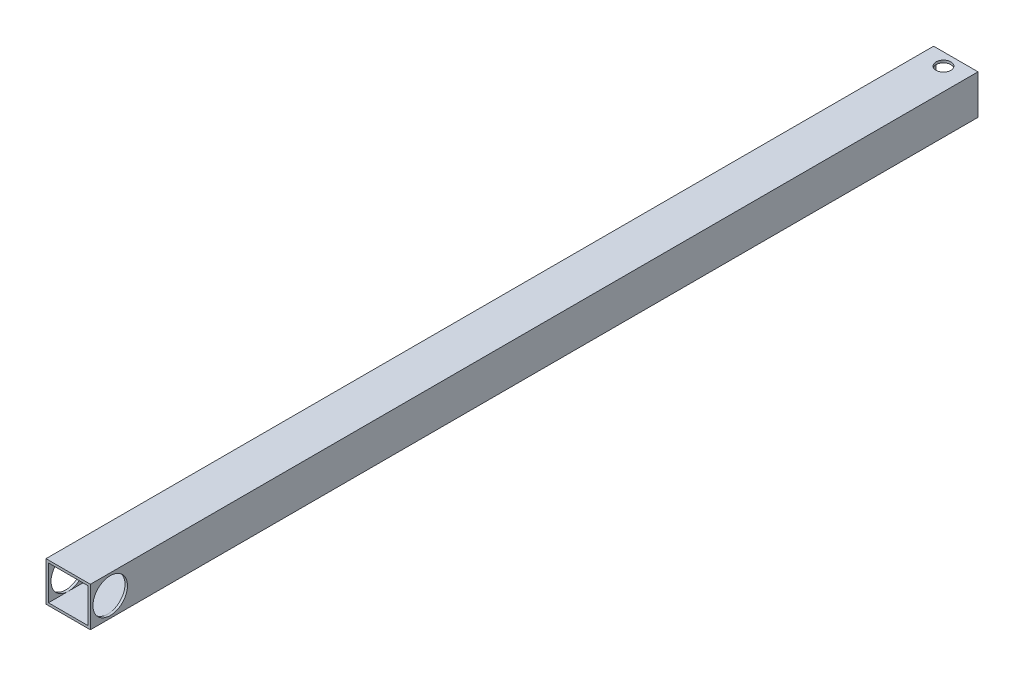
ISO-10303-21;
HEADER;
FILE_DESCRIPTION(('STEP AP214'),'2;1');
FILE_NAME('part.step','',(''),(''),'','','');
FILE_SCHEMA(('AUTOMOTIVE_DESIGN { 1 0 10303 214 1 1 1 1 }'));
ENDSEC;
DATA;
#1=APPLICATION_CONTEXT('core data for automotive mechanical design processes');
#2=APPLICATION_PROTOCOL_DEFINITION('international standard','automotive_design',2000,#1);
#3=PRODUCT_CONTEXT('',#1,'mechanical');
#4=PRODUCT('Part','Part','',(#3));
#5=PRODUCT_RELATED_PRODUCT_CATEGORY('part','',(#4));
#6=PRODUCT_DEFINITION_FORMATION('','',#4);
#7=PRODUCT_DEFINITION_CONTEXT('part definition',#1,'design');
#8=PRODUCT_DEFINITION('design','',#6,#7);
#9=PRODUCT_DEFINITION_SHAPE('','',#8);
#10=(LENGTH_UNIT() NAMED_UNIT(*) SI_UNIT(.MILLI.,.METRE.));
#11=(NAMED_UNIT(*) PLANE_ANGLE_UNIT() SI_UNIT($,.RADIAN.));
#12=(NAMED_UNIT(*) SI_UNIT($,.STERADIAN.) SOLID_ANGLE_UNIT());
#13=UNCERTAINTY_MEASURE_WITH_UNIT(LENGTH_MEASURE(1.E-05),#10,'distance_accuracy_value','');
#14=(GEOMETRIC_REPRESENTATION_CONTEXT(3) GLOBAL_UNCERTAINTY_ASSIGNED_CONTEXT((#13)) GLOBAL_UNIT_ASSIGNED_CONTEXT((#10,
#11,#12)) REPRESENTATION_CONTEXT('',''));
#15=CARTESIAN_POINT('',(0.,0.,0.));
#16=DIRECTION('',(0.,0.,1.));
#17=DIRECTION('',(1.,0.,0.));
#18=AXIS2_PLACEMENT_3D('',#15,#16,#17);
#19=CARTESIAN_POINT('',(4.,3.5,180.));
#20=DIRECTION('',(-1.,0.,0.));
#21=DIRECTION('',(0.,0.,1.));
#22=AXIS2_PLACEMENT_3D('',#19,#20,#21);
#23=PLANE('',#22);
#24=CARTESIAN_POINT('',(4.,0.,175.980500670806));
#25=DIRECTION('',(-1.,0.,0.));
#26=DIRECTION('',(0.,0.,1.));
#27=AXIS2_PLACEMENT_3D('',#24,#25,#26);
#28=CIRCLE('',#27,3.49999999999999);
#29=CARTESIAN_POINT('',(4.,3.5,175.980500670806));
#30=VERTEX_POINT('',#29);
#31=CARTESIAN_POINT('',(4.,-3.5,175.980500670806));
#32=VERTEX_POINT('',#31);
#33=EDGE_CURVE('E55',#30,#32,#28,.T.);
#34=ORIENTED_EDGE('',*,*,#33,.F.);
#35=DIRECTION('',(0.,0.,-1.));
#36=VECTOR('',#35,1.);
#37=CARTESIAN_POINT('',(4.,3.5,180.));
#38=LINE('',#37,#36);
#39=CARTESIAN_POINT('',(4.,3.5,0.));
#40=VERTEX_POINT('',#39);
#41=EDGE_CURVE('E143',#30,#40,#38,.T.);
#42=ORIENTED_EDGE('',*,*,#41,.T.);
#43=DIRECTION('',(0.,1.,0.));
#44=VECTOR('',#43,1.);
#45=CARTESIAN_POINT('',(4.,3.5,0.));
#46=LINE('',#45,#44);
#47=CARTESIAN_POINT('',(4.,-3.5,0.));
#48=VERTEX_POINT('',#47);
#49=EDGE_CURVE('E235',#48,#40,#46,.T.);
#50=ORIENTED_EDGE('',*,*,#49,.F.);
#51=DIRECTION('',(0.,0.,-1.));
#52=VECTOR('',#51,1.);
#53=CARTESIAN_POINT('',(4.,-3.5,180.));
#54=LINE('',#53,#52);
#55=EDGE_CURVE('E233',#32,#48,#54,.T.);
#56=ORIENTED_EDGE('',*,*,#55,.F.);
#57=EDGE_LOOP('',(#34,#42,#50,#56));
#58=FACE_BOUND('',#57,.T.);
#59=ADVANCED_FACE('F41',(#58),#23,.T.);
#60=CARTESIAN_POINT('',(-4.,3.5,180.));
#61=DIRECTION('',(1.,0.,0.));
#62=DIRECTION('',(0.,0.,-1.));
#63=AXIS2_PLACEMENT_3D('',#60,#61,#62);
#64=PLANE('',#63);
#65=CARTESIAN_POINT('',(-4.,0.,175.980500670806));
#66=DIRECTION('',(1.,0.,0.));
#67=DIRECTION('',(0.,0.,-1.));
#68=AXIS2_PLACEMENT_3D('',#65,#66,#67);
#69=CIRCLE('',#68,3.49999999999999);
#70=CARTESIAN_POINT('',(-4.,3.5,175.980500670806));
#71=VERTEX_POINT('',#70);
#72=CARTESIAN_POINT('',(-4.,-3.5,175.980500670806));
#73=VERTEX_POINT('',#72);
#74=EDGE_CURVE('E11',#71,#73,#69,.T.);
#75=ORIENTED_EDGE('',*,*,#74,.F.);
#76=DIRECTION('',(0.,0.,-1.));
#77=VECTOR('',#76,1.);
#78=CARTESIAN_POINT('',(-4.,3.5,180.));
#79=LINE('',#78,#77);
#80=CARTESIAN_POINT('',(-4.,3.5,180.));
#81=VERTEX_POINT('',#80);
#82=EDGE_CURVE('E125',#81,#71,#79,.T.);
#83=ORIENTED_EDGE('',*,*,#82,.F.);
#84=DIRECTION('',(0.,-1.,0.));
#85=VECTOR('',#84,1.);
#86=CARTESIAN_POINT('',(-4.,3.5,180.));
#87=LINE('',#86,#85);
#88=CARTESIAN_POINT('',(-4.,-3.5,180.));
#89=VERTEX_POINT('',#88);
#90=EDGE_CURVE('E251',#81,#89,#87,.T.);
#91=ORIENTED_EDGE('',*,*,#90,.T.);
#92=DIRECTION('',(0.,0.,-1.));
#93=VECTOR('',#92,1.);
#94=CARTESIAN_POINT('',(-4.,-3.5,180.));
#95=LINE('',#94,#93);
#96=EDGE_CURVE('E127',#89,#73,#95,.T.);
#97=ORIENTED_EDGE('',*,*,#96,.T.);
#98=EDGE_LOOP('',(#75,#83,#91,#97));
#99=FACE_BOUND('',#98,.T.);
#100=ADVANCED_FACE('F122',(#99),#64,.T.);
#101=CARTESIAN_POINT('',(0.,0.,180.));
#102=DIRECTION('',(0.,0.,1.));
#103=DIRECTION('',(1.,0.,0.));
#104=AXIS2_PLACEMENT_3D('',#101,#102,#103);
#105=PLANE('',#104);
#106=DIRECTION('',(0.,1.,0.));
#107=VECTOR('',#106,1.);
#108=CARTESIAN_POINT('',(4.5,4.,180.));
#109=LINE('',#108,#107);
#110=CARTESIAN_POINT('',(4.5,-4.,180.));
#111=VERTEX_POINT('',#110);
#112=CARTESIAN_POINT('',(4.5,4.,180.));
#113=VERTEX_POINT('',#112);
#114=EDGE_CURVE('E159',#111,#113,#109,.T.);
#115=ORIENTED_EDGE('',*,*,#114,.T.);
#116=DIRECTION('',(-1.,0.,0.));
#117=VECTOR('',#116,1.);
#118=CARTESIAN_POINT('',(-4.5,4.,180.));
#119=LINE('',#118,#117);
#120=CARTESIAN_POINT('',(-4.5,4.,180.));
#121=VERTEX_POINT('',#120);
#122=EDGE_CURVE('E162',#113,#121,#119,.T.);
#123=ORIENTED_EDGE('',*,*,#122,.T.);
#124=DIRECTION('',(0.,-1.,0.));
#125=VECTOR('',#124,1.);
#126=CARTESIAN_POINT('',(-4.5,4.,180.));
#127=LINE('',#126,#125);
#128=CARTESIAN_POINT('',(-4.5,-4.,180.));
#129=VERTEX_POINT('',#128);
#130=EDGE_CURVE('E165',#121,#129,#127,.T.);
#131=ORIENTED_EDGE('',*,*,#130,.T.);
#132=DIRECTION('',(1.,0.,0.));
#133=VECTOR('',#132,1.);
#134=CARTESIAN_POINT('',(-4.5,-4.,180.));
#135=LINE('',#134,#133);
#136=EDGE_CURVE('E167',#129,#111,#135,.T.);
#137=ORIENTED_EDGE('',*,*,#136,.T.);
#138=EDGE_LOOP('',(#115,#123,#131,#137));
#139=FACE_BOUND('',#138,.T.);
#140=DIRECTION('',(-1.,0.,0.));
#141=VECTOR('',#140,1.);
#142=CARTESIAN_POINT('',(-4.,3.5,180.));
#143=LINE('',#142,#141);
#144=CARTESIAN_POINT('',(4.,3.5,180.));
#145=VERTEX_POINT('',#144);
#146=EDGE_CURVE('E142',#145,#81,#143,.T.);
#147=ORIENTED_EDGE('',*,*,#146,.F.);
#148=DIRECTION('',(0.,1.,0.));
#149=VECTOR('',#148,1.);
#150=CARTESIAN_POINT('',(4.,3.5,180.));
#151=LINE('',#150,#149);
#152=CARTESIAN_POINT('',(4.,-3.5,180.));
#153=VERTEX_POINT('',#152);
#154=EDGE_CURVE('E245',#153,#145,#151,.T.);
#155=ORIENTED_EDGE('',*,*,#154,.F.);
#156=DIRECTION('',(1.,0.,0.));
#157=VECTOR('',#156,1.);
#158=CARTESIAN_POINT('',(-4.,-3.5,180.));
#159=LINE('',#158,#157);
#160=EDGE_CURVE('E238',#89,#153,#159,.T.);
#161=ORIENTED_EDGE('',*,*,#160,.F.);
#162=ORIENTED_EDGE('',*,*,#90,.F.);
#163=EDGE_LOOP('',(#147,#155,#161,#162));
#164=FACE_BOUND('',#163,.T.);
#165=ADVANCED_FACE('F202',(#139,#164),#105,.T.);
#166=CARTESIAN_POINT('',(0.,0.,0.));
#167=DIRECTION('',(0.,0.,1.));
#168=DIRECTION('',(1.,0.,0.));
#169=AXIS2_PLACEMENT_3D('',#166,#167,#168);
#170=PLANE('',#169);
#171=DIRECTION('',(0.,1.,0.));
#172=VECTOR('',#171,1.);
#173=CARTESIAN_POINT('',(4.5,4.,0.));
#174=LINE('',#173,#172);
#175=CARTESIAN_POINT('',(4.5,-4.,0.));
#176=VERTEX_POINT('',#175);
#177=CARTESIAN_POINT('',(4.5,4.,0.));
#178=VERTEX_POINT('',#177);
#179=EDGE_CURVE('E154',#176,#178,#174,.T.);
#180=ORIENTED_EDGE('',*,*,#179,.F.);
#181=DIRECTION('',(1.,0.,0.));
#182=VECTOR('',#181,1.);
#183=CARTESIAN_POINT('',(-4.5,-4.,0.));
#184=LINE('',#183,#182);
#185=CARTESIAN_POINT('',(-4.5,-4.,0.));
#186=VERTEX_POINT('',#185);
#187=EDGE_CURVE('E163',#186,#176,#184,.T.);
#188=ORIENTED_EDGE('',*,*,#187,.F.);
#189=DIRECTION('',(0.,-1.,0.));
#190=VECTOR('',#189,1.);
#191=CARTESIAN_POINT('',(-4.5,4.,0.));
#192=LINE('',#191,#190);
#193=CARTESIAN_POINT('',(-4.5,4.,0.));
#194=VERTEX_POINT('',#193);
#195=EDGE_CURVE('E174',#194,#186,#192,.T.);
#196=ORIENTED_EDGE('',*,*,#195,.F.);
#197=DIRECTION('',(-1.,0.,0.));
#198=VECTOR('',#197,1.);
#199=CARTESIAN_POINT('',(-4.5,4.,0.));
#200=LINE('',#199,#198);
#201=EDGE_CURVE('E172',#178,#194,#200,.T.);
#202=ORIENTED_EDGE('',*,*,#201,.F.);
#203=EDGE_LOOP('',(#180,#188,#196,#202));
#204=FACE_BOUND('',#203,.T.);
#205=ORIENTED_EDGE('',*,*,#49,.T.);
#206=DIRECTION('',(-1.,0.,0.));
#207=VECTOR('',#206,1.);
#208=CARTESIAN_POINT('',(-4.,3.5,0.));
#209=LINE('',#208,#207);
#210=CARTESIAN_POINT('',(-4.,3.5,0.));
#211=VERTEX_POINT('',#210);
#212=EDGE_CURVE('E247',#40,#211,#209,.T.);
#213=ORIENTED_EDGE('',*,*,#212,.T.);
#214=DIRECTION('',(0.,-1.,0.));
#215=VECTOR('',#214,1.);
#216=CARTESIAN_POINT('',(-4.,3.5,0.));
#217=LINE('',#216,#215);
#218=CARTESIAN_POINT('',(-4.,-3.5,0.));
#219=VERTEX_POINT('',#218);
#220=EDGE_CURVE('E132',#211,#219,#217,.T.);
#221=ORIENTED_EDGE('',*,*,#220,.T.);
#222=DIRECTION('',(1.,0.,0.));
#223=VECTOR('',#222,1.);
#224=CARTESIAN_POINT('',(-4.,-3.5,0.));
#225=LINE('',#224,#223);
#226=EDGE_CURVE('E243',#219,#48,#225,.T.);
#227=ORIENTED_EDGE('',*,*,#226,.T.);
#228=EDGE_LOOP('',(#205,#213,#221,#227));
#229=FACE_BOUND('',#228,.T.);
#230=ADVANCED_FACE('F194',(#204,#229),#170,.F.);
#231=CARTESIAN_POINT('',(0.,-4.,2.50038415483546));
#232=DIRECTION('',(0.,1.,0.));
#233=DIRECTION('',(0.,0.,1.));
#234=AXIS2_PLACEMENT_3D('',#231,#232,#233);
#235=CYLINDRICAL_SURFACE('',#234,1.5);
#236=CARTESIAN_POINT('',(0.,4.,2.50038415483546));
#237=DIRECTION('',(0.,1.,0.));
#238=DIRECTION('',(0.,0.,1.));
#239=AXIS2_PLACEMENT_3D('',#236,#237,#238);
#240=CIRCLE('',#239,1.5);
#241=CARTESIAN_POINT('',(0.,4.,4.00038415483546));
#242=VERTEX_POINT('',#241);
#243=EDGE_CURVE('E155',#242,#242,#240,.T.);
#244=ORIENTED_EDGE('',*,*,#243,.T.);
#245=EDGE_LOOP('',(#244));
#246=FACE_BOUND('',#245,.T.);
#247=CARTESIAN_POINT('',(0.,3.5,2.50038415483546));
#248=DIRECTION('',(0.,-1.,0.));
#249=DIRECTION('',(0.,0.,-1.));
#250=AXIS2_PLACEMENT_3D('',#247,#248,#249);
#251=CIRCLE('',#250,1.5);
#252=CARTESIAN_POINT('',(0.,3.5,1.00038415483546));
#253=VERTEX_POINT('',#252);
#254=EDGE_CURVE('E158',#253,#253,#251,.F.);
#255=ORIENTED_EDGE('',*,*,#254,.F.);
#256=EDGE_LOOP('',(#255));
#257=FACE_BOUND('',#256,.T.);
#258=ADVANCED_FACE('F191',(#246,#257),#235,.F.);
#259=CARTESIAN_POINT('',(0.,-4.,2.50038415483546));
#260=DIRECTION('',(0.,1.,0.));
#261=DIRECTION('',(0.,0.,1.));
#262=AXIS2_PLACEMENT_3D('',#259,#260,#261);
#263=CIRCLE('',#262,1.5);
#264=CARTESIAN_POINT('',(0.,-4.,4.00038415483546));
#265=VERTEX_POINT('',#264);
#266=EDGE_CURVE('E151',#265,#265,#263,.T.);
#267=ORIENTED_EDGE('',*,*,#266,.F.);
#268=EDGE_LOOP('',(#267));
#269=FACE_BOUND('',#268,.T.);
#270=CARTESIAN_POINT('',(0.,-3.5,2.50038415483546));
#271=DIRECTION('',(0.,1.,0.));
#272=DIRECTION('',(0.,0.,1.));
#273=AXIS2_PLACEMENT_3D('',#270,#271,#272);
#274=CIRCLE('',#273,1.5);
#275=CARTESIAN_POINT('',(0.,-3.5,4.00038415483546));
#276=VERTEX_POINT('',#275);
#277=EDGE_CURVE('E150',#276,#276,#274,.F.);
#278=ORIENTED_EDGE('',*,*,#277,.F.);
#279=EDGE_LOOP('',(#278));
#280=FACE_BOUND('',#279,.T.);
#281=ADVANCED_FACE('F193',(#269,#280),#235,.F.);
#282=CARTESIAN_POINT('',(4.5,4.,180.));
#283=DIRECTION('',(-1.,0.,0.));
#284=DIRECTION('',(0.,-1.,0.));
#285=AXIS2_PLACEMENT_3D('',#282,#283,#284);
#286=PLANE('',#285);
#287=CARTESIAN_POINT('',(4.5,0.,175.980500670806));
#288=DIRECTION('',(1.,0.,0.));
#289=DIRECTION('',(0.,1.,0.));
#290=AXIS2_PLACEMENT_3D('',#287,#288,#289);
#291=CIRCLE('',#290,3.49999999999999);
#292=CARTESIAN_POINT('',(4.5,3.49999999999999,175.980500670806));
#293=VERTEX_POINT('',#292);
#294=EDGE_CURVE('E255',#293,#293,#291,.T.);
#295=ORIENTED_EDGE('',*,*,#294,.F.);
#296=EDGE_LOOP('',(#295));
#297=FACE_BOUND('',#296,.T.);
#298=ORIENTED_EDGE('',*,*,#179,.T.);
#299=DIRECTION('',(0.,0.,-1.));
#300=VECTOR('',#299,1.);
#301=CARTESIAN_POINT('',(4.5,4.,180.));
#302=LINE('',#301,#300);
#303=EDGE_CURVE('E118',#113,#178,#302,.T.);
#304=ORIENTED_EDGE('',*,*,#303,.F.);
#305=ORIENTED_EDGE('',*,*,#114,.F.);
#306=DIRECTION('',(0.,0.,-1.));
#307=VECTOR('',#306,1.);
#308=CARTESIAN_POINT('',(4.5,-4.,180.));
#309=LINE('',#308,#307);
#310=EDGE_CURVE('E169',#111,#176,#309,.T.);
#311=ORIENTED_EDGE('',*,*,#310,.T.);
#312=EDGE_LOOP('',(#298,#304,#305,#311));
#313=FACE_BOUND('',#312,.T.);
#314=ADVANCED_FACE('F43',(#297,#313),#286,.F.);
#315=CARTESIAN_POINT('',(-4.5,4.,180.));
#316=DIRECTION('',(0.,-1.,0.));
#317=DIRECTION('',(0.,0.,-1.));
#318=AXIS2_PLACEMENT_3D('',#315,#316,#317);
#319=PLANE('',#318);
#320=ORIENTED_EDGE('',*,*,#243,.F.);
#321=EDGE_LOOP('',(#320));
#322=FACE_BOUND('',#321,.T.);
#323=ORIENTED_EDGE('',*,*,#201,.T.);
#324=DIRECTION('',(0.,0.,-1.));
#325=VECTOR('',#324,1.);
#326=CARTESIAN_POINT('',(-4.5,4.,180.));
#327=LINE('',#326,#325);
#328=EDGE_CURVE('E182',#121,#194,#327,.T.);
#329=ORIENTED_EDGE('',*,*,#328,.F.);
#330=ORIENTED_EDGE('',*,*,#122,.F.);
#331=ORIENTED_EDGE('',*,*,#303,.T.);
#332=EDGE_LOOP('',(#323,#329,#330,#331));
#333=FACE_BOUND('',#332,.T.);
#334=ADVANCED_FACE('F281',(#322,#333),#319,.F.);
#335=CARTESIAN_POINT('',(-4.5,4.,180.));
#336=DIRECTION('',(1.,0.,0.));
#337=DIRECTION('',(0.,1.,0.));
#338=AXIS2_PLACEMENT_3D('',#335,#336,#337);
#339=PLANE('',#338);
#340=CARTESIAN_POINT('',(-4.5,0.,175.980500670806));
#341=DIRECTION('',(1.,0.,0.));
#342=DIRECTION('',(0.,1.,0.));
#343=AXIS2_PLACEMENT_3D('',#340,#341,#342);
#344=CIRCLE('',#343,3.49999999999999);
#345=CARTESIAN_POINT('',(-4.5,3.49999999999999,175.980500670806));
#346=VERTEX_POINT('',#345);
#347=EDGE_CURVE('E230',#346,#346,#344,.T.);
#348=ORIENTED_EDGE('',*,*,#347,.T.);
#349=EDGE_LOOP('',(#348));
#350=FACE_BOUND('',#349,.T.);
#351=ORIENTED_EDGE('',*,*,#195,.T.);
#352=DIRECTION('',(0.,0.,-1.));
#353=VECTOR('',#352,1.);
#354=CARTESIAN_POINT('',(-4.5,-4.,180.));
#355=LINE('',#354,#353);
#356=EDGE_CURVE('E179',#129,#186,#355,.T.);
#357=ORIENTED_EDGE('',*,*,#356,.F.);
#358=ORIENTED_EDGE('',*,*,#130,.F.);
#359=ORIENTED_EDGE('',*,*,#328,.T.);
#360=EDGE_LOOP('',(#351,#357,#358,#359));
#361=FACE_BOUND('',#360,.T.);
#362=ADVANCED_FACE('F261',(#350,#361),#339,.F.);
#363=CARTESIAN_POINT('',(-4.5,-4.,180.));
#364=DIRECTION('',(0.,1.,0.));
#365=DIRECTION('',(0.,0.,1.));
#366=AXIS2_PLACEMENT_3D('',#363,#364,#365);
#367=PLANE('',#366);
#368=ORIENTED_EDGE('',*,*,#266,.T.);
#369=EDGE_LOOP('',(#368));
#370=FACE_BOUND('',#369,.T.);
#371=ORIENTED_EDGE('',*,*,#187,.T.);
#372=ORIENTED_EDGE('',*,*,#310,.F.);
#373=ORIENTED_EDGE('',*,*,#136,.F.);
#374=ORIENTED_EDGE('',*,*,#356,.T.);
#375=EDGE_LOOP('',(#371,#372,#373,#374));
#376=FACE_BOUND('',#375,.T.);
#377=ADVANCED_FACE('F270',(#370,#376),#367,.F.);
#378=CARTESIAN_POINT('',(-4.,3.5,180.));
#379=DIRECTION('',(0.,-1.,0.));
#380=DIRECTION('',(0.,0.,-1.));
#381=AXIS2_PLACEMENT_3D('',#378,#379,#380);
#382=PLANE('',#381);
#383=ORIENTED_EDGE('',*,*,#41,.F.);
#384=EDGE_CURVE('E144',#145,#30,#38,.T.);
#385=ORIENTED_EDGE('',*,*,#384,.F.);
#386=ORIENTED_EDGE('',*,*,#146,.T.);
#387=ORIENTED_EDGE('',*,*,#82,.T.);
#388=EDGE_CURVE('E129',#71,#211,#79,.T.);
#389=ORIENTED_EDGE('',*,*,#388,.T.);
#390=ORIENTED_EDGE('',*,*,#212,.F.);
#391=EDGE_LOOP('',(#383,#385,#386,#387,#389,#390));
#392=FACE_BOUND('',#391,.T.);
#393=ORIENTED_EDGE('',*,*,#254,.T.);
#394=EDGE_LOOP('',(#393));
#395=FACE_BOUND('',#394,.T.);
#396=ADVANCED_FACE('F138',(#392,#395),#382,.T.);
#397=CARTESIAN_POINT('',(-4.,-3.5,180.));
#398=DIRECTION('',(0.,1.,0.));
#399=DIRECTION('',(0.,0.,1.));
#400=AXIS2_PLACEMENT_3D('',#397,#398,#399);
#401=PLANE('',#400);
#402=EDGE_CURVE('E228',#153,#32,#54,.T.);
#403=ORIENTED_EDGE('',*,*,#402,.T.);
#404=ORIENTED_EDGE('',*,*,#55,.T.);
#405=ORIENTED_EDGE('',*,*,#226,.F.);
#406=EDGE_CURVE('E241',#73,#219,#95,.T.);
#407=ORIENTED_EDGE('',*,*,#406,.F.);
#408=ORIENTED_EDGE('',*,*,#96,.F.);
#409=ORIENTED_EDGE('',*,*,#160,.T.);
#410=EDGE_LOOP('',(#403,#404,#405,#407,#408,#409));
#411=FACE_BOUND('',#410,.T.);
#412=ORIENTED_EDGE('',*,*,#277,.T.);
#413=EDGE_LOOP('',(#412));
#414=FACE_BOUND('',#413,.T.);
#415=ADVANCED_FACE('F216',(#411,#414),#401,.T.);
#416=EDGE_CURVE('E225',#32,#30,#28,.T.);
#417=ORIENTED_EDGE('',*,*,#416,.F.);
#418=ORIENTED_EDGE('',*,*,#402,.F.);
#419=ORIENTED_EDGE('',*,*,#154,.T.);
#420=ORIENTED_EDGE('',*,*,#384,.T.);
#421=EDGE_LOOP('',(#417,#418,#419,#420));
#422=FACE_BOUND('',#421,.T.);
#423=ADVANCED_FACE('F209',(#422),#23,.T.);
#424=EDGE_CURVE('E45',#73,#71,#69,.T.);
#425=ORIENTED_EDGE('',*,*,#424,.F.);
#426=ORIENTED_EDGE('',*,*,#406,.T.);
#427=ORIENTED_EDGE('',*,*,#220,.F.);
#428=ORIENTED_EDGE('',*,*,#388,.F.);
#429=EDGE_LOOP('',(#425,#426,#427,#428));
#430=FACE_BOUND('',#429,.T.);
#431=ADVANCED_FACE('F130',(#430),#64,.T.);
#432=CARTESIAN_POINT('',(-4.5,0.,175.980500670806));
#433=DIRECTION('',(1.,0.,0.));
#434=DIRECTION('',(0.,1.,0.));
#435=AXIS2_PLACEMENT_3D('',#432,#433,#434);
#436=CYLINDRICAL_SURFACE('',#435,3.49999999999999);
#437=ORIENTED_EDGE('',*,*,#74,.T.);
#438=ORIENTED_EDGE('',*,*,#424,.T.);
#439=EDGE_LOOP('',(#437,#438));
#440=FACE_BOUND('',#439,.T.);
#441=ORIENTED_EDGE('',*,*,#347,.F.);
#442=EDGE_LOOP('',(#441));
#443=FACE_BOUND('',#442,.T.);
#444=ADVANCED_FACE('F113',(#440,#443),#436,.F.);
#445=ORIENTED_EDGE('',*,*,#33,.T.);
#446=ORIENTED_EDGE('',*,*,#416,.T.);
#447=EDGE_LOOP('',(#445,#446));
#448=FACE_BOUND('',#447,.T.);
#449=ORIENTED_EDGE('',*,*,#294,.T.);
#450=EDGE_LOOP('',(#449));
#451=FACE_BOUND('',#450,.T.);
#452=ADVANCED_FACE('F264',(#448,#451),#436,.F.);
#453=CLOSED_SHELL('',(#59,#100,#165,#230,#258,#281,#314,#334,#362,#377,#396,#415,#423,#431,#444,#452));
#454=MANIFOLD_SOLID_BREP('B2',#453);
#455=ADVANCED_BREP_SHAPE_REPRESENTATION('',(#18,#454),#14);
#456=SHAPE_DEFINITION_REPRESENTATION(#9,#455);
ENDSEC;
END-ISO-10303-21;
